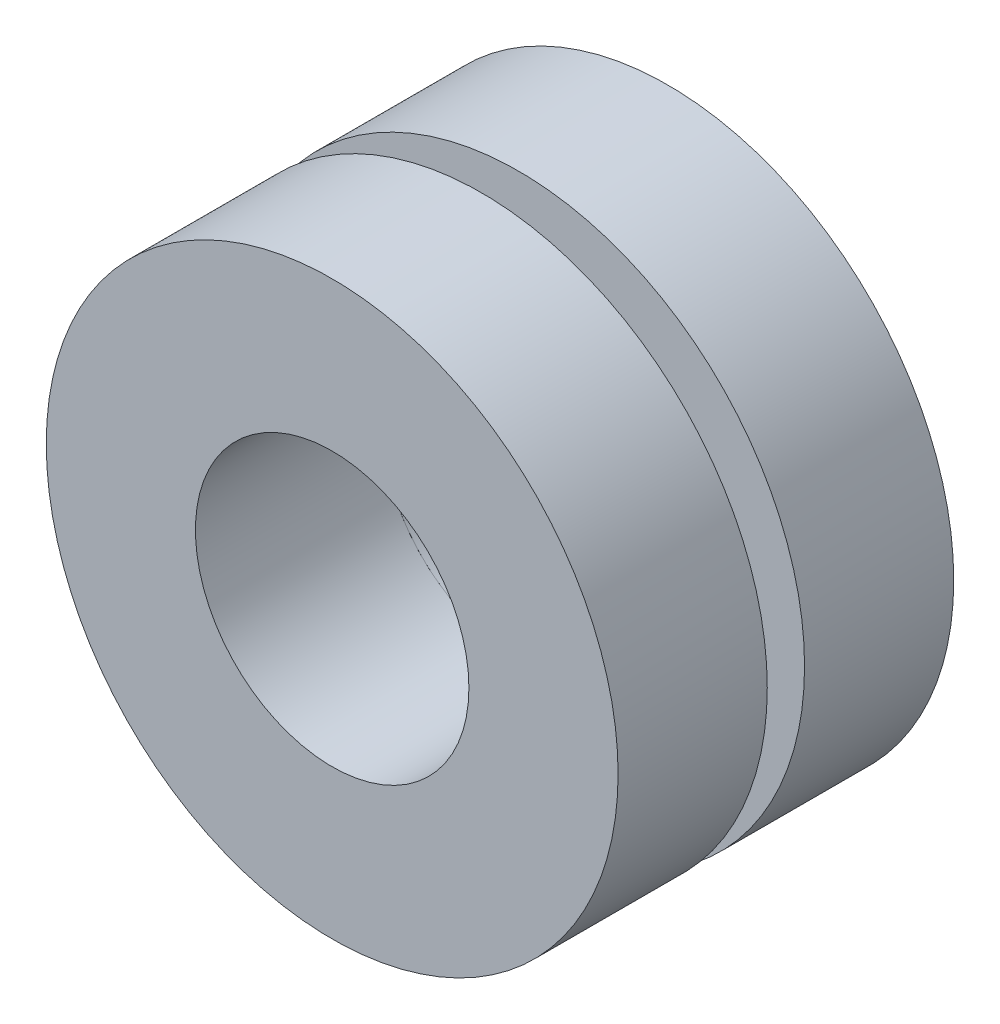
ISO-10303-21;
HEADER;
FILE_DESCRIPTION(('STEP AP214'),'2;1');
FILE_NAME('part.step','',(''),(''),'','','');
FILE_SCHEMA(('AUTOMOTIVE_DESIGN { 1 0 10303 214 1 1 1 1 }'));
ENDSEC;
DATA;
#1=APPLICATION_CONTEXT('core data for automotive mechanical design processes');
#2=APPLICATION_PROTOCOL_DEFINITION('international standard','automotive_design',2000,#1);
#3=PRODUCT_CONTEXT('',#1,'mechanical');
#4=PRODUCT('Part','Part','',(#3));
#5=PRODUCT_RELATED_PRODUCT_CATEGORY('part','',(#4));
#6=PRODUCT_DEFINITION_FORMATION('','',#4);
#7=PRODUCT_DEFINITION_CONTEXT('part definition',#1,'design');
#8=PRODUCT_DEFINITION('design','',#6,#7);
#9=PRODUCT_DEFINITION_SHAPE('','',#8);
#10=(LENGTH_UNIT() NAMED_UNIT(*) SI_UNIT(.MILLI.,.METRE.));
#11=(NAMED_UNIT(*) PLANE_ANGLE_UNIT() SI_UNIT($,.RADIAN.));
#12=(NAMED_UNIT(*) SI_UNIT($,.STERADIAN.) SOLID_ANGLE_UNIT());
#13=UNCERTAINTY_MEASURE_WITH_UNIT(LENGTH_MEASURE(1.E-05),#10,'distance_accuracy_value','');
#14=(GEOMETRIC_REPRESENTATION_CONTEXT(3) GLOBAL_UNCERTAINTY_ASSIGNED_CONTEXT((#13)) GLOBAL_UNIT_ASSIGNED_CONTEXT((#10,
#11,#12)) REPRESENTATION_CONTEXT('',''));
#15=CARTESIAN_POINT('',(0.,0.,0.));
#16=DIRECTION('',(0.,0.,1.));
#17=DIRECTION('',(1.,0.,0.));
#18=AXIS2_PLACEMENT_3D('',#15,#16,#17);
#19=CARTESIAN_POINT('',(0.,0.,-3.048));
#20=DIRECTION('',(0.,0.,-1.));
#21=DIRECTION('',(-1.,0.,0.));
#22=AXIS2_PLACEMENT_3D('',#19,#20,#21);
#23=PLANE('',#22);
#24=CARTESIAN_POINT('',(0.,0.,-3.048));
#25=DIRECTION('',(0.,0.,-1.));
#26=DIRECTION('',(-1.,0.,0.));
#27=AXIS2_PLACEMENT_3D('',#24,#25,#26);
#28=CIRCLE('',#27,5.842);
#29=CARTESIAN_POINT('',(-5.842,0.,-3.048));
#30=VERTEX_POINT('',#29);
#31=EDGE_CURVE('E11',#30,#30,#28,.T.);
#32=ORIENTED_EDGE('',*,*,#31,.T.);
#33=EDGE_LOOP('',(#32));
#34=FACE_BOUND('',#33,.T.);
#35=CARTESIAN_POINT('',(0.,0.,-3.048));
#36=DIRECTION('',(0.,0.,-1.));
#37=DIRECTION('',(-1.,0.,0.));
#38=AXIS2_PLACEMENT_3D('',#35,#36,#37);
#39=CIRCLE('',#38,2.794);
#40=CARTESIAN_POINT('',(-2.794,0.,-3.048));
#41=VERTEX_POINT('',#40);
#42=EDGE_CURVE('E52',#41,#41,#39,.T.);
#43=ORIENTED_EDGE('',*,*,#42,.F.);
#44=EDGE_LOOP('',(#43));
#45=FACE_BOUND('',#44,.T.);
#46=ADVANCED_FACE('F41',(#34,#45),#23,.T.);
#47=CARTESIAN_POINT('',(0.,0.,0.));
#48=DIRECTION('',(0.,0.,-1.));
#49=DIRECTION('',(-1.,0.,0.));
#50=AXIS2_PLACEMENT_3D('',#47,#48,#49);
#51=PLANE('',#50);
#52=CARTESIAN_POINT('',(0.,0.,0.));
#53=DIRECTION('',(0.,0.,-1.));
#54=DIRECTION('',(-1.,0.,0.));
#55=AXIS2_PLACEMENT_3D('',#52,#53,#54);
#56=CIRCLE('',#55,5.842);
#57=CARTESIAN_POINT('',(-5.842,0.,0.));
#58=VERTEX_POINT('',#57);
#59=EDGE_CURVE('E45',#58,#58,#56,.T.);
#60=ORIENTED_EDGE('',*,*,#59,.F.);
#61=EDGE_LOOP('',(#60));
#62=FACE_BOUND('',#61,.T.);
#63=CARTESIAN_POINT('',(0.,0.,0.));
#64=DIRECTION('',(0.,0.,-1.));
#65=DIRECTION('',(-1.,0.,0.));
#66=AXIS2_PLACEMENT_3D('',#63,#64,#65);
#67=CIRCLE('',#66,2.794);
#68=CARTESIAN_POINT('',(-2.794,0.,0.));
#69=VERTEX_POINT('',#68);
#70=EDGE_CURVE('E54',#69,#69,#67,.T.);
#71=ORIENTED_EDGE('',*,*,#70,.T.);
#72=EDGE_LOOP('',(#71));
#73=FACE_BOUND('',#72,.T.);
#74=ADVANCED_FACE('F64',(#62,#73),#51,.F.);
#75=CARTESIAN_POINT('',(0.,0.,-3.048));
#76=DIRECTION('',(0.,0.,1.));
#77=DIRECTION('',(1.,0.,0.));
#78=AXIS2_PLACEMENT_3D('',#75,#76,#77);
#79=CYLINDRICAL_SURFACE('',#78,5.842);
#80=ORIENTED_EDGE('',*,*,#31,.F.);
#81=EDGE_LOOP('',(#80));
#82=FACE_BOUND('',#81,.T.);
#83=ORIENTED_EDGE('',*,*,#59,.T.);
#84=EDGE_LOOP('',(#83));
#85=FACE_BOUND('',#84,.T.);
#86=ADVANCED_FACE('F43',(#82,#85),#79,.T.);
#87=CARTESIAN_POINT('',(0.,0.,-3.048));
#88=DIRECTION('',(0.,0.,1.));
#89=DIRECTION('',(1.,0.,0.));
#90=AXIS2_PLACEMENT_3D('',#87,#88,#89);
#91=CYLINDRICAL_SURFACE('',#90,2.794);
#92=ORIENTED_EDGE('',*,*,#42,.T.);
#93=EDGE_LOOP('',(#92));
#94=FACE_BOUND('',#93,.T.);
#95=ORIENTED_EDGE('',*,*,#70,.F.);
#96=EDGE_LOOP('',(#95));
#97=FACE_BOUND('',#96,.T.);
#98=ADVANCED_FACE('F60',(#94,#97),#91,.F.);
#99=CLOSED_SHELL('',(#46,#74,#86,#98));
#100=MANIFOLD_SOLID_BREP('B2',#99);
#101=CARTESIAN_POINT('',(0.,0.,0.));
#102=DIRECTION('',(0.,0.,1.));
#103=DIRECTION('',(1.,0.,0.));
#104=AXIS2_PLACEMENT_3D('',#101,#102,#103);
#105=PLANE('',#104);
#106=CARTESIAN_POINT('',(0.,0.,0.));
#107=DIRECTION('',(0.,0.,1.));
#108=DIRECTION('',(1.,0.,0.));
#109=AXIS2_PLACEMENT_3D('',#106,#107,#108);
#110=CIRCLE('',#109,4.572);
#111=CARTESIAN_POINT('',(4.572,0.,0.));
#112=VERTEX_POINT('',#111);
#113=EDGE_CURVE('E107',#112,#112,#110,.T.);
#114=ORIENTED_EDGE('',*,*,#113,.F.);
#115=EDGE_LOOP('',(#114));
#116=FACE_BOUND('',#115,.T.);
#117=CARTESIAN_POINT('',(0.,0.,0.));
#118=DIRECTION('',(0.,0.,1.));
#119=DIRECTION('',(1.,0.,0.));
#120=AXIS2_PLACEMENT_3D('',#117,#118,#119);
#121=CIRCLE('',#120,2.794);
#122=CARTESIAN_POINT('',(2.794,0.,0.));
#123=VERTEX_POINT('',#122);
#124=EDGE_CURVE('E114',#123,#123,#121,.T.);
#125=ORIENTED_EDGE('',*,*,#124,.T.);
#126=EDGE_LOOP('',(#125));
#127=FACE_BOUND('',#126,.T.);
#128=ADVANCED_FACE('F103',(#116,#127),#105,.F.);
#129=CARTESIAN_POINT('',(0.,0.,0.762));
#130=DIRECTION('',(0.,0.,-1.));
#131=DIRECTION('',(-1.,0.,0.));
#132=AXIS2_PLACEMENT_3D('',#129,#130,#131);
#133=CYLINDRICAL_SURFACE('',#132,4.572);
#134=CARTESIAN_POINT('',(0.,0.,0.762));
#135=DIRECTION('',(0.,0.,1.));
#136=DIRECTION('',(1.,0.,0.));
#137=AXIS2_PLACEMENT_3D('',#134,#135,#136);
#138=CIRCLE('',#137,4.572);
#139=CARTESIAN_POINT('',(4.572,0.,0.762));
#140=VERTEX_POINT('',#139);
#141=EDGE_CURVE('E40',#140,#140,#138,.T.);
#142=ORIENTED_EDGE('',*,*,#141,.F.);
#143=EDGE_LOOP('',(#142));
#144=FACE_BOUND('',#143,.T.);
#145=ORIENTED_EDGE('',*,*,#113,.T.);
#146=EDGE_LOOP('',(#145));
#147=FACE_BOUND('',#146,.T.);
#148=ADVANCED_FACE('F105',(#144,#147),#133,.T.);
#149=CARTESIAN_POINT('',(0.,0.,0.762));
#150=DIRECTION('',(0.,0.,-1.));
#151=DIRECTION('',(-1.,0.,0.));
#152=AXIS2_PLACEMENT_3D('',#149,#150,#151);
#153=CYLINDRICAL_SURFACE('',#152,2.794);
#154=ORIENTED_EDGE('',*,*,#124,.F.);
#155=EDGE_LOOP('',(#154));
#156=FACE_BOUND('',#155,.T.);
#157=CARTESIAN_POINT('',(0.,0.,3.81));
#158=DIRECTION('',(0.,0.,1.));
#159=DIRECTION('',(1.,0.,0.));
#160=AXIS2_PLACEMENT_3D('',#157,#158,#159);
#161=CIRCLE('',#160,2.794);
#162=CARTESIAN_POINT('',(2.794,0.,3.81));
#163=VERTEX_POINT('',#162);
#164=EDGE_CURVE('E122',#163,#163,#161,.T.);
#165=ORIENTED_EDGE('',*,*,#164,.T.);
#166=EDGE_LOOP('',(#165));
#167=FACE_BOUND('',#166,.T.);
#168=ADVANCED_FACE('F128',(#156,#167),#153,.F.);
#169=CARTESIAN_POINT('',(0.,0.,0.762));
#170=DIRECTION('',(0.,0.,1.));
#171=DIRECTION('',(1.,0.,0.));
#172=AXIS2_PLACEMENT_3D('',#169,#170,#171);
#173=PLANE('',#172);
#174=CARTESIAN_POINT('',(0.,0.,0.762));
#175=DIRECTION('',(0.,0.,1.));
#176=DIRECTION('',(1.,0.,0.));
#177=AXIS2_PLACEMENT_3D('',#174,#175,#176);
#178=CIRCLE('',#177,5.842);
#179=CARTESIAN_POINT('',(5.842,0.,0.762));
#180=VERTEX_POINT('',#179);
#181=EDGE_CURVE('E119',#180,#180,#178,.T.);
#182=ORIENTED_EDGE('',*,*,#181,.F.);
#183=EDGE_LOOP('',(#182));
#184=FACE_BOUND('',#183,.T.);
#185=ORIENTED_EDGE('',*,*,#141,.T.);
#186=EDGE_LOOP('',(#185));
#187=FACE_BOUND('',#186,.T.);
#188=ADVANCED_FACE('F133',(#184,#187),#173,.F.);
#189=CARTESIAN_POINT('',(0.,0.,3.81));
#190=DIRECTION('',(0.,0.,1.));
#191=DIRECTION('',(1.,0.,0.));
#192=AXIS2_PLACEMENT_3D('',#189,#190,#191);
#193=PLANE('',#192);
#194=CARTESIAN_POINT('',(0.,0.,3.81));
#195=DIRECTION('',(0.,0.,1.));
#196=DIRECTION('',(1.,0.,0.));
#197=AXIS2_PLACEMENT_3D('',#194,#195,#196);
#198=CIRCLE('',#197,5.842);
#199=CARTESIAN_POINT('',(5.842,0.,3.81));
#200=VERTEX_POINT('',#199);
#201=EDGE_CURVE('E118',#200,#200,#198,.T.);
#202=ORIENTED_EDGE('',*,*,#201,.T.);
#203=EDGE_LOOP('',(#202));
#204=FACE_BOUND('',#203,.T.);
#205=ORIENTED_EDGE('',*,*,#164,.F.);
#206=EDGE_LOOP('',(#205));
#207=FACE_BOUND('',#206,.T.);
#208=ADVANCED_FACE('F130',(#204,#207),#193,.T.);
#209=CARTESIAN_POINT('',(0.,0.,3.81));
#210=DIRECTION('',(0.,0.,-1.));
#211=DIRECTION('',(-1.,0.,0.));
#212=AXIS2_PLACEMENT_3D('',#209,#210,#211);
#213=CYLINDRICAL_SURFACE('',#212,5.842);
#214=ORIENTED_EDGE('',*,*,#201,.F.);
#215=EDGE_LOOP('',(#214));
#216=FACE_BOUND('',#215,.T.);
#217=ORIENTED_EDGE('',*,*,#181,.T.);
#218=EDGE_LOOP('',(#217));
#219=FACE_BOUND('',#218,.T.);
#220=ADVANCED_FACE('F132',(#216,#219),#213,.T.);
#221=CLOSED_SHELL('',(#128,#148,#168,#188,#208,#220));
#222=MANIFOLD_SOLID_BREP('B6',#221);
#223=ADVANCED_BREP_SHAPE_REPRESENTATION('',(#18,#100,#222),#14);
#224=SHAPE_DEFINITION_REPRESENTATION(#9,#223);
ENDSEC;
END-ISO-10303-21;
